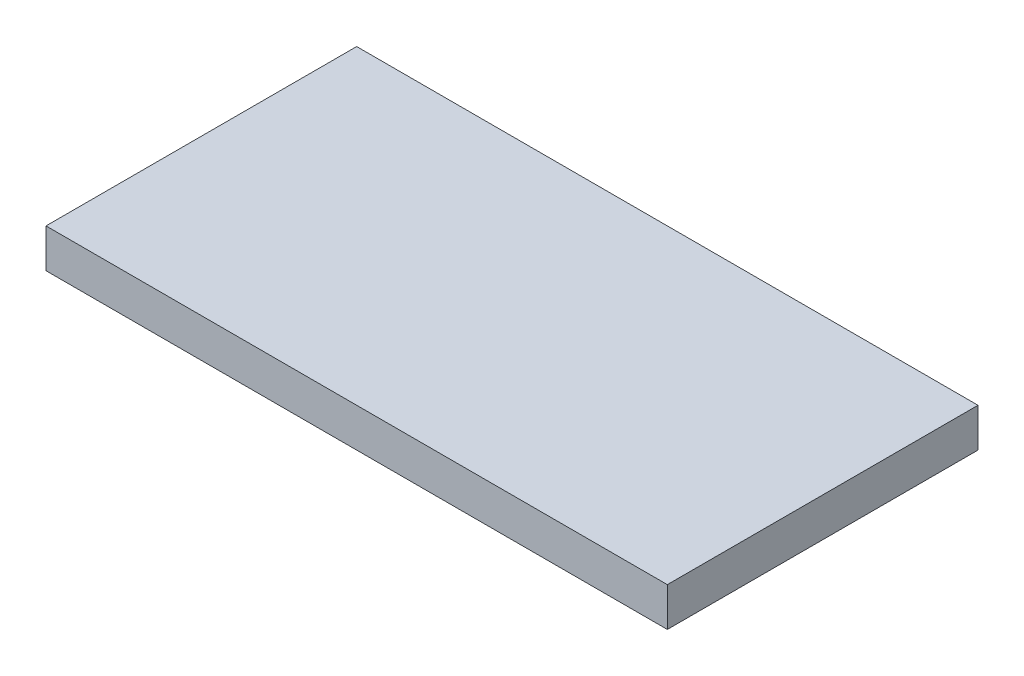
ISO-10303-21;
HEADER;
FILE_DESCRIPTION(('STEP AP214'),'2;1');
FILE_NAME('part.step','',(''),(''),'','','');
FILE_SCHEMA(('AUTOMOTIVE_DESIGN { 1 0 10303 214 1 1 1 1 }'));
ENDSEC;
DATA;
#1=APPLICATION_CONTEXT('core data for automotive mechanical design processes');
#2=APPLICATION_PROTOCOL_DEFINITION('international standard','automotive_design',2000,#1);
#3=PRODUCT_CONTEXT('',#1,'mechanical');
#4=PRODUCT('Part','Part','',(#3));
#5=PRODUCT_RELATED_PRODUCT_CATEGORY('part','',(#4));
#6=PRODUCT_DEFINITION_FORMATION('','',#4);
#7=PRODUCT_DEFINITION_CONTEXT('part definition',#1,'design');
#8=PRODUCT_DEFINITION('design','',#6,#7);
#9=PRODUCT_DEFINITION_SHAPE('','',#8);
#10=(LENGTH_UNIT() NAMED_UNIT(*) SI_UNIT(.MILLI.,.METRE.));
#11=(NAMED_UNIT(*) PLANE_ANGLE_UNIT() SI_UNIT($,.RADIAN.));
#12=(NAMED_UNIT(*) SI_UNIT($,.STERADIAN.) SOLID_ANGLE_UNIT());
#13=UNCERTAINTY_MEASURE_WITH_UNIT(LENGTH_MEASURE(1.E-05),#10,'distance_accuracy_value','');
#14=(GEOMETRIC_REPRESENTATION_CONTEXT(3) GLOBAL_UNCERTAINTY_ASSIGNED_CONTEXT((#13)) GLOBAL_UNIT_ASSIGNED_CONTEXT((#10,
#11,#12)) REPRESENTATION_CONTEXT('',''));
#15=CARTESIAN_POINT('',(0.,0.,0.));
#16=DIRECTION('',(0.,0.,1.));
#17=DIRECTION('',(1.,0.,0.));
#18=AXIS2_PLACEMENT_3D('',#15,#16,#17);
#19=CARTESIAN_POINT('',(0.,4.7625,0.));
#20=DIRECTION('',(1.,0.,0.));
#21=DIRECTION('',(0.,0.,-1.));
#22=AXIS2_PLACEMENT_3D('',#19,#20,#21);
#23=PLANE('',#22);
#24=DIRECTION('',(0.,0.,1.));
#25=VECTOR('',#24,1.);
#26=CARTESIAN_POINT('',(0.,0.,0.));
#27=LINE('',#26,#25);
#28=CARTESIAN_POINT('',(0.,0.,0.));
#29=VERTEX_POINT('',#28);
#30=CARTESIAN_POINT('',(0.,0.,38.1));
#31=VERTEX_POINT('',#30);
#32=EDGE_CURVE('E96',#29,#31,#27,.T.);
#33=ORIENTED_EDGE('',*,*,#32,.T.);
#34=DIRECTION('',(0.,-1.,0.));
#35=VECTOR('',#34,1.);
#36=CARTESIAN_POINT('',(0.,4.7625,38.1));
#37=LINE('',#36,#35);
#38=CARTESIAN_POINT('',(0.,4.7625,38.1));
#39=VERTEX_POINT('',#38);
#40=EDGE_CURVE('E11',#39,#31,#37,.T.);
#41=ORIENTED_EDGE('',*,*,#40,.F.);
#42=DIRECTION('',(0.,0.,1.));
#43=VECTOR('',#42,1.);
#44=CARTESIAN_POINT('',(0.,4.7625,0.));
#45=LINE('',#44,#43);
#46=CARTESIAN_POINT('',(0.,4.7625,0.));
#47=VERTEX_POINT('',#46);
#48=EDGE_CURVE('E82',#47,#39,#45,.T.);
#49=ORIENTED_EDGE('',*,*,#48,.F.);
#50=DIRECTION('',(0.,-1.,0.));
#51=VECTOR('',#50,1.);
#52=CARTESIAN_POINT('',(0.,4.7625,0.));
#53=LINE('',#52,#51);
#54=EDGE_CURVE('E49',#47,#29,#53,.T.);
#55=ORIENTED_EDGE('',*,*,#54,.T.);
#56=EDGE_LOOP('',(#33,#41,#49,#55));
#57=FACE_BOUND('',#56,.T.);
#58=ADVANCED_FACE('F33',(#57),#23,.F.);
#59=CARTESIAN_POINT('',(0.,4.7625,38.1));
#60=DIRECTION('',(0.,0.,-1.));
#61=DIRECTION('',(-1.,0.,0.));
#62=AXIS2_PLACEMENT_3D('',#59,#60,#61);
#63=PLANE('',#62);
#64=DIRECTION('',(1.,0.,0.));
#65=VECTOR('',#64,1.);
#66=CARTESIAN_POINT('',(0.,0.,38.1));
#67=LINE('',#66,#65);
#68=CARTESIAN_POINT('',(76.2,0.,38.1));
#69=VERTEX_POINT('',#68);
#70=EDGE_CURVE('E87',#31,#69,#67,.T.);
#71=ORIENTED_EDGE('',*,*,#70,.T.);
#72=DIRECTION('',(0.,-1.,0.));
#73=VECTOR('',#72,1.);
#74=CARTESIAN_POINT('',(76.2,4.7625,38.1));
#75=LINE('',#74,#73);
#76=CARTESIAN_POINT('',(76.2,4.7625,38.1));
#77=VERTEX_POINT('',#76);
#78=EDGE_CURVE('E41',#77,#69,#75,.T.);
#79=ORIENTED_EDGE('',*,*,#78,.F.);
#80=DIRECTION('',(1.,0.,0.));
#81=VECTOR('',#80,1.);
#82=CARTESIAN_POINT('',(0.,4.7625,38.1));
#83=LINE('',#82,#81);
#84=EDGE_CURVE('E74',#39,#77,#83,.T.);
#85=ORIENTED_EDGE('',*,*,#84,.F.);
#86=ORIENTED_EDGE('',*,*,#40,.T.);
#87=EDGE_LOOP('',(#71,#79,#85,#86));
#88=FACE_BOUND('',#87,.T.);
#89=ADVANCED_FACE('F86',(#88),#63,.F.);
#90=CARTESIAN_POINT('',(76.2,4.7625,0.));
#91=DIRECTION('',(1.,0.,0.));
#92=DIRECTION('',(0.,0.,-1.));
#93=AXIS2_PLACEMENT_3D('',#90,#91,#92);
#94=PLANE('',#93);
#95=DIRECTION('',(0.,0.,1.));
#96=VECTOR('',#95,1.);
#97=CARTESIAN_POINT('',(76.2,0.,0.));
#98=LINE('',#97,#96);
#99=CARTESIAN_POINT('',(76.2,0.,0.));
#100=VERTEX_POINT('',#99);
#101=EDGE_CURVE('E99',#100,#69,#98,.T.);
#102=ORIENTED_EDGE('',*,*,#101,.F.);
#103=DIRECTION('',(0.,-1.,0.));
#104=VECTOR('',#103,1.);
#105=CARTESIAN_POINT('',(76.2,4.7625,0.));
#106=LINE('',#105,#104);
#107=CARTESIAN_POINT('',(76.2,4.7625,0.));
#108=VERTEX_POINT('',#107);
#109=EDGE_CURVE('E63',#108,#100,#106,.T.);
#110=ORIENTED_EDGE('',*,*,#109,.F.);
#111=DIRECTION('',(0.,0.,1.));
#112=VECTOR('',#111,1.);
#113=CARTESIAN_POINT('',(76.2,4.7625,0.));
#114=LINE('',#113,#112);
#115=EDGE_CURVE('E81',#108,#77,#114,.T.);
#116=ORIENTED_EDGE('',*,*,#115,.T.);
#117=ORIENTED_EDGE('',*,*,#78,.T.);
#118=EDGE_LOOP('',(#102,#110,#116,#117));
#119=FACE_BOUND('',#118,.T.);
#120=ADVANCED_FACE('F90',(#119),#94,.T.);
#121=CARTESIAN_POINT('',(0.,4.7625,0.));
#122=DIRECTION('',(0.,0.,-1.));
#123=DIRECTION('',(-1.,0.,0.));
#124=AXIS2_PLACEMENT_3D('',#121,#122,#123);
#125=PLANE('',#124);
#126=DIRECTION('',(1.,0.,0.));
#127=VECTOR('',#126,1.);
#128=CARTESIAN_POINT('',(0.,0.,0.));
#129=LINE('',#128,#127);
#130=EDGE_CURVE('E101',#29,#100,#129,.T.);
#131=ORIENTED_EDGE('',*,*,#130,.F.);
#132=ORIENTED_EDGE('',*,*,#54,.F.);
#133=DIRECTION('',(1.,0.,0.));
#134=VECTOR('',#133,1.);
#135=CARTESIAN_POINT('',(0.,4.7625,0.));
#136=LINE('',#135,#134);
#137=EDGE_CURVE('E91',#47,#108,#136,.T.);
#138=ORIENTED_EDGE('',*,*,#137,.T.);
#139=ORIENTED_EDGE('',*,*,#109,.T.);
#140=EDGE_LOOP('',(#131,#132,#138,#139));
#141=FACE_BOUND('',#140,.T.);
#142=ADVANCED_FACE('F107',(#141),#125,.T.);
#143=CARTESIAN_POINT('',(0.,4.7625,0.));
#144=DIRECTION('',(0.,1.,0.));
#145=DIRECTION('',(0.,0.,1.));
#146=AXIS2_PLACEMENT_3D('',#143,#144,#145);
#147=PLANE('',#146);
#148=ORIENTED_EDGE('',*,*,#48,.T.);
#149=ORIENTED_EDGE('',*,*,#84,.T.);
#150=ORIENTED_EDGE('',*,*,#115,.F.);
#151=ORIENTED_EDGE('',*,*,#137,.F.);
#152=EDGE_LOOP('',(#148,#149,#150,#151));
#153=FACE_BOUND('',#152,.T.);
#154=ADVANCED_FACE('F78',(#153),#147,.T.);
#155=CARTESIAN_POINT('',(0.,0.,0.));
#156=DIRECTION('',(0.,1.,0.));
#157=DIRECTION('',(0.,0.,1.));
#158=AXIS2_PLACEMENT_3D('',#155,#156,#157);
#159=PLANE('',#158);
#160=ORIENTED_EDGE('',*,*,#32,.F.);
#161=ORIENTED_EDGE('',*,*,#130,.T.);
#162=ORIENTED_EDGE('',*,*,#101,.T.);
#163=ORIENTED_EDGE('',*,*,#70,.F.);
#164=EDGE_LOOP('',(#160,#161,#162,#163));
#165=FACE_BOUND('',#164,.T.);
#166=ADVANCED_FACE('F106',(#165),#159,.F.);
#167=CLOSED_SHELL('',(#58,#89,#120,#142,#154,#166));
#168=MANIFOLD_SOLID_BREP('B2',#167);
#169=ADVANCED_BREP_SHAPE_REPRESENTATION('',(#18,#168),#14);
#170=SHAPE_DEFINITION_REPRESENTATION(#9,#169);
ENDSEC;
END-ISO-10303-21;
